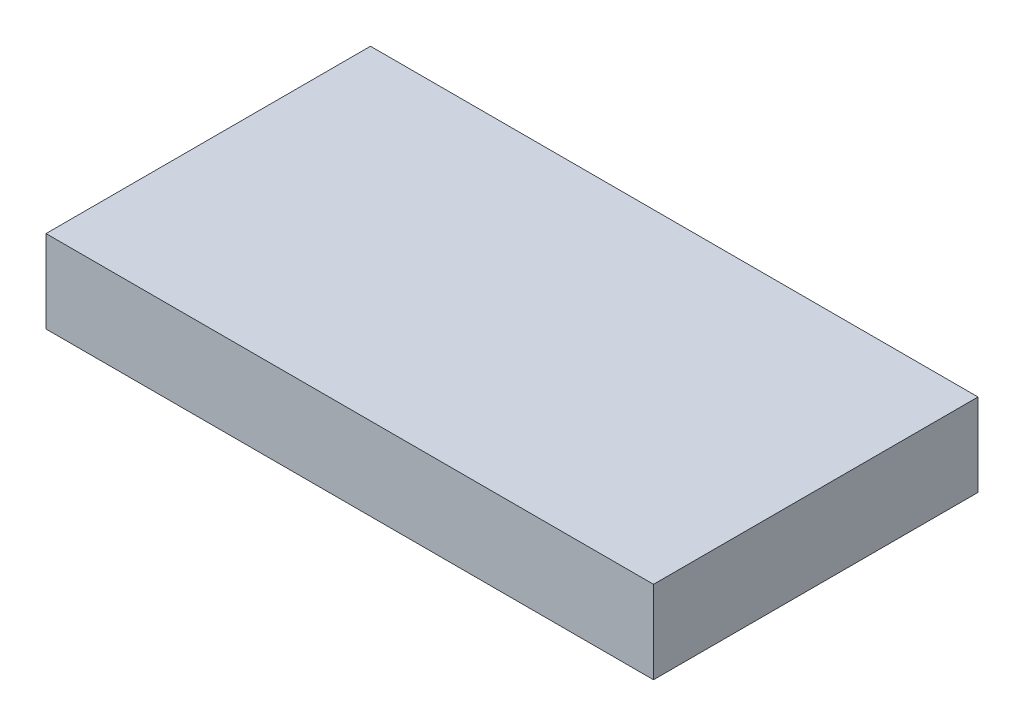
ISO-10303-21;
HEADER;
FILE_DESCRIPTION(('STEP AP214'),'2;1');
FILE_NAME('part.step','',(''),(''),'','','');
FILE_SCHEMA(('AUTOMOTIVE_DESIGN { 1 0 10303 214 1 1 1 1 }'));
ENDSEC;
DATA;
#1=APPLICATION_CONTEXT('core data for automotive mechanical design processes');
#2=APPLICATION_PROTOCOL_DEFINITION('international standard','automotive_design',2000,#1);
#3=PRODUCT_CONTEXT('',#1,'mechanical');
#4=PRODUCT('Part','Part','',(#3));
#5=PRODUCT_RELATED_PRODUCT_CATEGORY('part','',(#4));
#6=PRODUCT_DEFINITION_FORMATION('','',#4);
#7=PRODUCT_DEFINITION_CONTEXT('part definition',#1,'design');
#8=PRODUCT_DEFINITION('design','',#6,#7);
#9=PRODUCT_DEFINITION_SHAPE('','',#8);
#10=(LENGTH_UNIT() NAMED_UNIT(*) SI_UNIT(.MILLI.,.METRE.));
#11=(NAMED_UNIT(*) PLANE_ANGLE_UNIT() SI_UNIT($,.RADIAN.));
#12=(NAMED_UNIT(*) SI_UNIT($,.STERADIAN.) SOLID_ANGLE_UNIT());
#13=UNCERTAINTY_MEASURE_WITH_UNIT(LENGTH_MEASURE(1.E-05),#10,'distance_accuracy_value','');
#14=(GEOMETRIC_REPRESENTATION_CONTEXT(3) GLOBAL_UNCERTAINTY_ASSIGNED_CONTEXT((#13)) GLOBAL_UNIT_ASSIGNED_CONTEXT((#10,
#11,#12)) REPRESENTATION_CONTEXT('',''));
#15=CARTESIAN_POINT('',(0.,0.,0.));
#16=DIRECTION('',(0.,0.,1.));
#17=DIRECTION('',(1.,0.,0.));
#18=AXIS2_PLACEMENT_3D('',#15,#16,#17);
#19=CARTESIAN_POINT('',(0.,3.83,0.));
#20=DIRECTION('',(1.,0.,0.));
#21=DIRECTION('',(0.,0.,-1.));
#22=AXIS2_PLACEMENT_3D('',#19,#20,#21);
#23=PLANE('',#22);
#24=DIRECTION('',(0.,0.,1.));
#25=VECTOR('',#24,1.);
#26=CARTESIAN_POINT('',(0.,0.,0.));
#27=LINE('',#26,#25);
#28=CARTESIAN_POINT('',(0.,0.,0.));
#29=VERTEX_POINT('',#28);
#30=CARTESIAN_POINT('',(0.,0.,15.03));
#31=VERTEX_POINT('',#30);
#32=EDGE_CURVE('E96',#29,#31,#27,.T.);
#33=ORIENTED_EDGE('',*,*,#32,.T.);
#34=DIRECTION('',(0.,-1.,0.));
#35=VECTOR('',#34,1.);
#36=CARTESIAN_POINT('',(0.,3.83,15.03));
#37=LINE('',#36,#35);
#38=CARTESIAN_POINT('',(0.,3.83,15.03));
#39=VERTEX_POINT('',#38);
#40=EDGE_CURVE('E11',#39,#31,#37,.T.);
#41=ORIENTED_EDGE('',*,*,#40,.F.);
#42=DIRECTION('',(0.,0.,1.));
#43=VECTOR('',#42,1.);
#44=CARTESIAN_POINT('',(0.,3.83,0.));
#45=LINE('',#44,#43);
#46=CARTESIAN_POINT('',(0.,3.83,0.));
#47=VERTEX_POINT('',#46);
#48=EDGE_CURVE('E84',#47,#39,#45,.T.);
#49=ORIENTED_EDGE('',*,*,#48,.F.);
#50=DIRECTION('',(0.,-1.,0.));
#51=VECTOR('',#50,1.);
#52=CARTESIAN_POINT('',(0.,3.83,0.));
#53=LINE('',#52,#51);
#54=EDGE_CURVE('E92',#47,#29,#53,.T.);
#55=ORIENTED_EDGE('',*,*,#54,.T.);
#56=EDGE_LOOP('',(#33,#41,#49,#55));
#57=FACE_BOUND('',#56,.T.);
#58=ADVANCED_FACE('F33',(#57),#23,.F.);
#59=CARTESIAN_POINT('',(0.,3.83,15.03));
#60=DIRECTION('',(0.,0.,-1.));
#61=DIRECTION('',(-1.,0.,0.));
#62=AXIS2_PLACEMENT_3D('',#59,#60,#61);
#63=PLANE('',#62);
#64=DIRECTION('',(1.,0.,0.));
#65=VECTOR('',#64,1.);
#66=CARTESIAN_POINT('',(0.,0.,15.03));
#67=LINE('',#66,#65);
#68=CARTESIAN_POINT('',(28.14,0.,15.03));
#69=VERTEX_POINT('',#68);
#70=EDGE_CURVE('E88',#31,#69,#67,.T.);
#71=ORIENTED_EDGE('',*,*,#70,.T.);
#72=DIRECTION('',(0.,-1.,0.));
#73=VECTOR('',#72,1.);
#74=CARTESIAN_POINT('',(28.14,3.83,15.03));
#75=LINE('',#74,#73);
#76=CARTESIAN_POINT('',(28.14,3.83,15.03));
#77=VERTEX_POINT('',#76);
#78=EDGE_CURVE('E41',#77,#69,#75,.T.);
#79=ORIENTED_EDGE('',*,*,#78,.F.);
#80=DIRECTION('',(1.,0.,0.));
#81=VECTOR('',#80,1.);
#82=CARTESIAN_POINT('',(0.,3.83,15.03));
#83=LINE('',#82,#81);
#84=EDGE_CURVE('E79',#39,#77,#83,.T.);
#85=ORIENTED_EDGE('',*,*,#84,.F.);
#86=ORIENTED_EDGE('',*,*,#40,.T.);
#87=EDGE_LOOP('',(#71,#79,#85,#86));
#88=FACE_BOUND('',#87,.T.);
#89=ADVANCED_FACE('F87',(#88),#63,.F.);
#90=CARTESIAN_POINT('',(28.14,3.83,0.));
#91=DIRECTION('',(-1.,0.,0.));
#92=DIRECTION('',(0.,0.,1.));
#93=AXIS2_PLACEMENT_3D('',#90,#91,#92);
#94=PLANE('',#93);
#95=DIRECTION('',(0.,0.,-1.));
#96=VECTOR('',#95,1.);
#97=CARTESIAN_POINT('',(28.14,0.,0.));
#98=LINE('',#97,#96);
#99=CARTESIAN_POINT('',(28.14,0.,0.));
#100=VERTEX_POINT('',#99);
#101=EDGE_CURVE('E66',#69,#100,#98,.T.);
#102=ORIENTED_EDGE('',*,*,#101,.T.);
#103=DIRECTION('',(0.,-1.,0.));
#104=VECTOR('',#103,1.);
#105=CARTESIAN_POINT('',(28.14,3.83,0.));
#106=LINE('',#105,#104);
#107=CARTESIAN_POINT('',(28.14,3.83,0.));
#108=VERTEX_POINT('',#107);
#109=EDGE_CURVE('E89',#108,#100,#106,.T.);
#110=ORIENTED_EDGE('',*,*,#109,.F.);
#111=DIRECTION('',(0.,0.,-1.));
#112=VECTOR('',#111,1.);
#113=CARTESIAN_POINT('',(28.14,3.83,0.));
#114=LINE('',#113,#112);
#115=EDGE_CURVE('E82',#77,#108,#114,.T.);
#116=ORIENTED_EDGE('',*,*,#115,.F.);
#117=ORIENTED_EDGE('',*,*,#78,.T.);
#118=EDGE_LOOP('',(#102,#110,#116,#117));
#119=FACE_BOUND('',#118,.T.);
#120=ADVANCED_FACE('F90',(#119),#94,.F.);
#121=CARTESIAN_POINT('',(0.,3.83,0.));
#122=DIRECTION('',(0.,0.,1.));
#123=DIRECTION('',(1.,0.,0.));
#124=AXIS2_PLACEMENT_3D('',#121,#122,#123);
#125=PLANE('',#124);
#126=DIRECTION('',(-1.,0.,0.));
#127=VECTOR('',#126,1.);
#128=CARTESIAN_POINT('',(0.,0.,0.));
#129=LINE('',#128,#127);
#130=EDGE_CURVE('E72',#100,#29,#129,.T.);
#131=ORIENTED_EDGE('',*,*,#130,.T.);
#132=ORIENTED_EDGE('',*,*,#54,.F.);
#133=DIRECTION('',(-1.,0.,0.));
#134=VECTOR('',#133,1.);
#135=CARTESIAN_POINT('',(0.,3.83,0.));
#136=LINE('',#135,#134);
#137=EDGE_CURVE('E49',#108,#47,#136,.T.);
#138=ORIENTED_EDGE('',*,*,#137,.F.);
#139=ORIENTED_EDGE('',*,*,#109,.T.);
#140=EDGE_LOOP('',(#131,#132,#138,#139));
#141=FACE_BOUND('',#140,.T.);
#142=ADVANCED_FACE('F103',(#141),#125,.F.);
#143=CARTESIAN_POINT('',(0.,3.83,0.));
#144=DIRECTION('',(0.,1.,0.));
#145=DIRECTION('',(0.,0.,1.));
#146=AXIS2_PLACEMENT_3D('',#143,#144,#145);
#147=PLANE('',#146);
#148=ORIENTED_EDGE('',*,*,#48,.T.);
#149=ORIENTED_EDGE('',*,*,#84,.T.);
#150=ORIENTED_EDGE('',*,*,#115,.T.);
#151=ORIENTED_EDGE('',*,*,#137,.T.);
#152=EDGE_LOOP('',(#148,#149,#150,#151));
#153=FACE_BOUND('',#152,.T.);
#154=ADVANCED_FACE('F80',(#153),#147,.T.);
#155=CARTESIAN_POINT('',(0.,0.,0.));
#156=DIRECTION('',(0.,1.,0.));
#157=DIRECTION('',(0.,0.,1.));
#158=AXIS2_PLACEMENT_3D('',#155,#156,#157);
#159=PLANE('',#158);
#160=ORIENTED_EDGE('',*,*,#32,.F.);
#161=ORIENTED_EDGE('',*,*,#130,.F.);
#162=ORIENTED_EDGE('',*,*,#101,.F.);
#163=ORIENTED_EDGE('',*,*,#70,.F.);
#164=EDGE_LOOP('',(#160,#161,#162,#163));
#165=FACE_BOUND('',#164,.T.);
#166=ADVANCED_FACE('F106',(#165),#159,.F.);
#167=CLOSED_SHELL('',(#58,#89,#120,#142,#154,#166));
#168=MANIFOLD_SOLID_BREP('B2',#167);
#169=ADVANCED_BREP_SHAPE_REPRESENTATION('',(#18,#168),#14);
#170=SHAPE_DEFINITION_REPRESENTATION(#9,#169);
ENDSEC;
END-ISO-10303-21;
